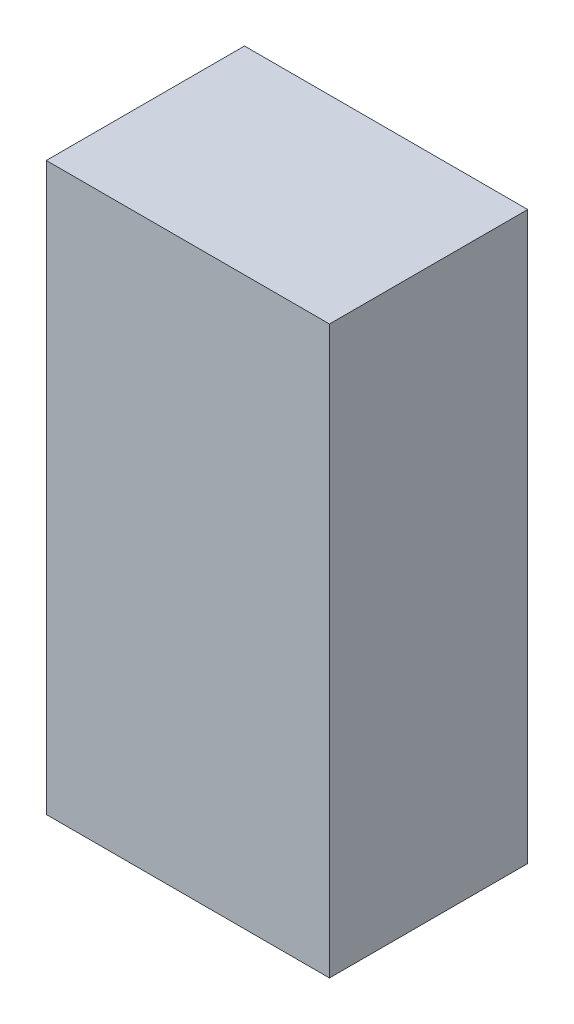
ISO-10303-21;
HEADER;
FILE_DESCRIPTION(('STEP AP214'),'2;1');
FILE_NAME('part.step','',(''),(''),'','','');
FILE_SCHEMA(('AUTOMOTIVE_DESIGN { 1 0 10303 214 1 1 1 1 }'));
ENDSEC;
DATA;
#1=APPLICATION_CONTEXT('core data for automotive mechanical design processes');
#2=APPLICATION_PROTOCOL_DEFINITION('international standard','automotive_design',2000,#1);
#3=PRODUCT_CONTEXT('',#1,'mechanical');
#4=PRODUCT('Part','Part','',(#3));
#5=PRODUCT_RELATED_PRODUCT_CATEGORY('part','',(#4));
#6=PRODUCT_DEFINITION_FORMATION('','',#4);
#7=PRODUCT_DEFINITION_CONTEXT('part definition',#1,'design');
#8=PRODUCT_DEFINITION('design','',#6,#7);
#9=PRODUCT_DEFINITION_SHAPE('','',#8);
#10=(LENGTH_UNIT() NAMED_UNIT(*) SI_UNIT(.MILLI.,.METRE.));
#11=(NAMED_UNIT(*) PLANE_ANGLE_UNIT() SI_UNIT($,.RADIAN.));
#12=(NAMED_UNIT(*) SI_UNIT($,.STERADIAN.) SOLID_ANGLE_UNIT());
#13=UNCERTAINTY_MEASURE_WITH_UNIT(LENGTH_MEASURE(1.E-05),#10,'distance_accuracy_value','');
#14=(GEOMETRIC_REPRESENTATION_CONTEXT(3) GLOBAL_UNCERTAINTY_ASSIGNED_CONTEXT((#13)) GLOBAL_UNIT_ASSIGNED_CONTEXT((#10,
#11,#12)) REPRESENTATION_CONTEXT('',''));
#15=CARTESIAN_POINT('',(0.,0.,0.));
#16=DIRECTION('',(0.,0.,1.));
#17=DIRECTION('',(1.,0.,0.));
#18=AXIS2_PLACEMENT_3D('',#15,#16,#17);
#19=CARTESIAN_POINT('',(-0.2499995,-0.499999,0.3499993));
#20=DIRECTION('',(0.,0.,1.));
#21=DIRECTION('',(1.,0.,0.));
#22=AXIS2_PLACEMENT_3D('',#19,#20,#21);
#23=PLANE('',#22);
#24=DIRECTION('',(1.,0.,0.));
#25=VECTOR('',#24,1.);
#26=CARTESIAN_POINT('',(0.2499995,0.50000154,0.3499993));
#27=LINE('',#26,#25);
#28=CARTESIAN_POINT('',(0.2499995,0.50000154,0.3499993));
#29=VERTEX_POINT('',#28);
#30=CARTESIAN_POINT('',(-0.2499995,0.50000154,0.3499993));
#31=VERTEX_POINT('',#30);
#32=EDGE_CURVE('E75',#29,#31,#27,.F.);
#33=ORIENTED_EDGE('',*,*,#32,.T.);
#34=DIRECTION('',(0.,1.,0.));
#35=VECTOR('',#34,1.);
#36=CARTESIAN_POINT('',(-0.2499995,0.50000154,0.3499993));
#37=LINE('',#36,#35);
#38=CARTESIAN_POINT('',(-0.249998865,-0.499997095,0.3499993));
#39=VERTEX_POINT('',#38);
#40=EDGE_CURVE('E57',#31,#39,#37,.F.);
#41=ORIENTED_EDGE('',*,*,#40,.T.);
#42=DIRECTION('',(1.,0.,0.));
#43=VECTOR('',#42,1.);
#44=CARTESIAN_POINT('',(-0.24999696,-0.49999646,0.3499993));
#45=LINE('',#44,#43);
#46=CARTESIAN_POINT('',(0.2499995,-0.49999646,0.3499993));
#47=VERTEX_POINT('',#46);
#48=EDGE_CURVE('E19',#39,#47,#45,.T.);
#49=ORIENTED_EDGE('',*,*,#48,.T.);
#50=DIRECTION('',(0.,1.,0.));
#51=VECTOR('',#50,1.);
#52=CARTESIAN_POINT('',(0.2499995,-0.49999646,0.3499993));
#53=LINE('',#52,#51);
#54=EDGE_CURVE('E54',#47,#29,#53,.T.);
#55=ORIENTED_EDGE('',*,*,#54,.T.);
#56=EDGE_LOOP('',(#33,#41,#49,#55));
#57=FACE_BOUND('',#56,.T.);
#58=ADVANCED_FACE('F16',(#57),#23,.T.);
#59=CARTESIAN_POINT('',(-0.24999696,-0.49999646,0.));
#60=DIRECTION('',(0.,1.,0.));
#61=DIRECTION('',(0.,0.,1.));
#62=AXIS2_PLACEMENT_3D('',#59,#60,#61);
#63=PLANE('',#62);
#64=DIRECTION('',(0.,0.,1.));
#65=VECTOR('',#64,1.);
#66=CARTESIAN_POINT('',(0.2499995,-0.49999646,0.));
#67=LINE('',#66,#65);
#68=CARTESIAN_POINT('',(0.2499995,-0.49999646,0.));
#69=VERTEX_POINT('',#68);
#70=EDGE_CURVE('E62',#69,#47,#67,.T.);
#71=ORIENTED_EDGE('',*,*,#70,.T.);
#72=ORIENTED_EDGE('',*,*,#48,.F.);
#73=DIRECTION('',(0.,0.,-1.));
#74=VECTOR('',#73,1.);
#75=CARTESIAN_POINT('',(-0.2499995,-0.499999,0.));
#76=LINE('',#75,#74);
#77=CARTESIAN_POINT('',(-0.24999823,-0.499997095,0.));
#78=VERTEX_POINT('',#77);
#79=EDGE_CURVE('E79',#39,#78,#76,.T.);
#80=ORIENTED_EDGE('',*,*,#79,.T.);
#81=DIRECTION('',(1.,0.,0.));
#82=VECTOR('',#81,1.);
#83=CARTESIAN_POINT('',(-0.2499995,-0.49999646,0.));
#84=LINE('',#83,#82);
#85=EDGE_CURVE('E72',#78,#69,#84,.T.);
#86=ORIENTED_EDGE('',*,*,#85,.T.);
#87=EDGE_LOOP('',(#71,#72,#80,#86));
#88=FACE_BOUND('',#87,.T.);
#89=ADVANCED_FACE('F71',(#88),#63,.F.);
#90=CARTESIAN_POINT('',(0.2499995,-0.49999646,0.));
#91=DIRECTION('',(-1.,0.,0.));
#92=DIRECTION('',(0.,0.,1.));
#93=AXIS2_PLACEMENT_3D('',#90,#91,#92);
#94=PLANE('',#93);
#95=DIRECTION('',(0.,0.,-1.));
#96=VECTOR('',#95,1.);
#97=CARTESIAN_POINT('',(0.2499995,0.50000154,0.));
#98=LINE('',#97,#96);
#99=CARTESIAN_POINT('',(0.2499995,0.50000154,0.));
#100=VERTEX_POINT('',#99);
#101=EDGE_CURVE('E68',#100,#29,#98,.F.);
#102=ORIENTED_EDGE('',*,*,#101,.T.);
#103=ORIENTED_EDGE('',*,*,#54,.F.);
#104=ORIENTED_EDGE('',*,*,#70,.F.);
#105=DIRECTION('',(0.,1.,0.));
#106=VECTOR('',#105,1.);
#107=CARTESIAN_POINT('',(0.2499995,-0.499999,0.));
#108=LINE('',#107,#106);
#109=EDGE_CURVE('E82',#69,#100,#108,.T.);
#110=ORIENTED_EDGE('',*,*,#109,.T.);
#111=EDGE_LOOP('',(#102,#103,#104,#110));
#112=FACE_BOUND('',#111,.T.);
#113=ADVANCED_FACE('F65',(#112),#94,.F.);
#114=CARTESIAN_POINT('',(0.2499995,0.50000154,0.));
#115=DIRECTION('',(0.,-1.,0.));
#116=DIRECTION('',(0.,0.,-1.));
#117=AXIS2_PLACEMENT_3D('',#114,#115,#116);
#118=PLANE('',#117);
#119=DIRECTION('',(0.,0.,-1.));
#120=VECTOR('',#119,1.);
#121=CARTESIAN_POINT('',(-0.2499995,0.50000154,0.));
#122=LINE('',#121,#120);
#123=CARTESIAN_POINT('',(-0.2499995,0.50000154,0.));
#124=VERTEX_POINT('',#123);
#125=EDGE_CURVE('E33',#124,#31,#122,.F.);
#126=ORIENTED_EDGE('',*,*,#125,.T.);
#127=ORIENTED_EDGE('',*,*,#32,.F.);
#128=ORIENTED_EDGE('',*,*,#101,.F.);
#129=DIRECTION('',(1.,0.,0.));
#130=VECTOR('',#129,1.);
#131=CARTESIAN_POINT('',(-0.2499995,0.50000154,0.));
#132=LINE('',#131,#130);
#133=EDGE_CURVE('E25',#100,#124,#132,.F.);
#134=ORIENTED_EDGE('',*,*,#133,.T.);
#135=EDGE_LOOP('',(#126,#127,#128,#134));
#136=FACE_BOUND('',#135,.T.);
#137=ADVANCED_FACE('F87',(#136),#118,.F.);
#138=CARTESIAN_POINT('',(-0.2499995,0.50000154,0.));
#139=DIRECTION('',(1.,0.,0.));
#140=DIRECTION('',(0.,0.,-1.));
#141=AXIS2_PLACEMENT_3D('',#138,#139,#140);
#142=PLANE('',#141);
#143=ORIENTED_EDGE('',*,*,#79,.F.);
#144=ORIENTED_EDGE('',*,*,#40,.F.);
#145=ORIENTED_EDGE('',*,*,#125,.F.);
#146=DIRECTION('',(0.,1.,0.));
#147=VECTOR('',#146,1.);
#148=CARTESIAN_POINT('',(-0.2499995,-0.499999,0.));
#149=LINE('',#148,#147);
#150=EDGE_CURVE('E11',#124,#78,#149,.F.);
#151=ORIENTED_EDGE('',*,*,#150,.T.);
#152=EDGE_LOOP('',(#143,#144,#145,#151));
#153=FACE_BOUND('',#152,.T.);
#154=ADVANCED_FACE('F90',(#153),#142,.F.);
#155=CARTESIAN_POINT('',(-0.2499995,-0.499999,0.));
#156=DIRECTION('',(0.,0.,1.));
#157=DIRECTION('',(1.,0.,0.));
#158=AXIS2_PLACEMENT_3D('',#155,#156,#157);
#159=PLANE('',#158);
#160=ORIENTED_EDGE('',*,*,#133,.F.);
#161=ORIENTED_EDGE('',*,*,#109,.F.);
#162=ORIENTED_EDGE('',*,*,#85,.F.);
#163=ORIENTED_EDGE('',*,*,#150,.F.);
#164=EDGE_LOOP('',(#160,#161,#162,#163));
#165=FACE_BOUND('',#164,.T.);
#166=ADVANCED_FACE('F89',(#165),#159,.F.);
#167=CLOSED_SHELL('',(#58,#89,#113,#137,#154,#166));
#168=MANIFOLD_SOLID_BREP('B1',#167);
#169=ADVANCED_BREP_SHAPE_REPRESENTATION('',(#18,#168),#14);
#170=SHAPE_DEFINITION_REPRESENTATION(#9,#169);
ENDSEC;
END-ISO-10303-21;
